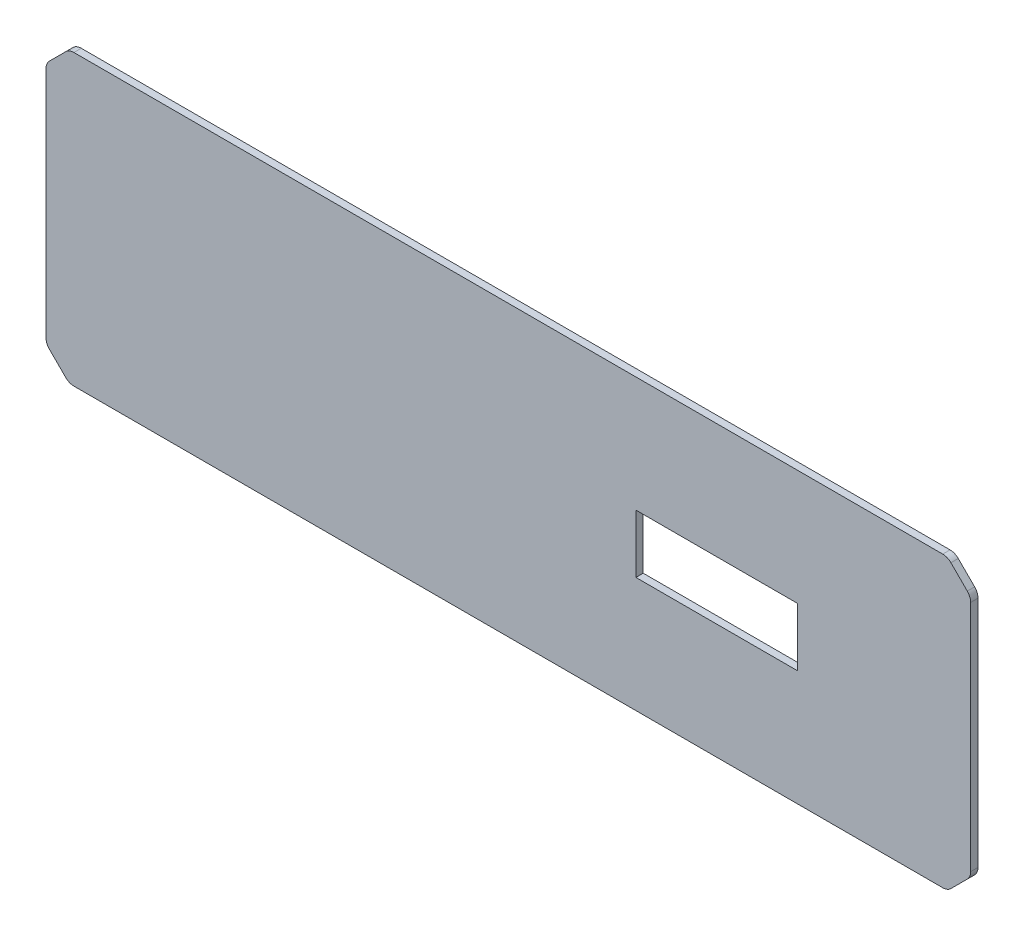
ISO-10303-21;
HEADER;
FILE_DESCRIPTION(('STEP AP214'),'2;1');
FILE_NAME('part.step','',(''),(''),'','','');
FILE_SCHEMA(('AUTOMOTIVE_DESIGN { 1 0 10303 214 1 1 1 1 }'));
ENDSEC;
DATA;
#1=APPLICATION_CONTEXT('core data for automotive mechanical design processes');
#2=APPLICATION_PROTOCOL_DEFINITION('international standard','automotive_design',2000,#1);
#3=PRODUCT_CONTEXT('',#1,'mechanical');
#4=PRODUCT('Part','Part','',(#3));
#5=PRODUCT_RELATED_PRODUCT_CATEGORY('part','',(#4));
#6=PRODUCT_DEFINITION_FORMATION('','',#4);
#7=PRODUCT_DEFINITION_CONTEXT('part definition',#1,'design');
#8=PRODUCT_DEFINITION('design','',#6,#7);
#9=PRODUCT_DEFINITION_SHAPE('','',#8);
#10=(LENGTH_UNIT() NAMED_UNIT(*) SI_UNIT(.MILLI.,.METRE.));
#11=(NAMED_UNIT(*) PLANE_ANGLE_UNIT() SI_UNIT($,.RADIAN.));
#12=(NAMED_UNIT(*) SI_UNIT($,.STERADIAN.) SOLID_ANGLE_UNIT());
#13=UNCERTAINTY_MEASURE_WITH_UNIT(LENGTH_MEASURE(1.E-05),#10,'distance_accuracy_value','');
#14=(GEOMETRIC_REPRESENTATION_CONTEXT(3) GLOBAL_UNCERTAINTY_ASSIGNED_CONTEXT((#13)) GLOBAL_UNIT_ASSIGNED_CONTEXT((#10,
#11,#12)) REPRESENTATION_CONTEXT('',''));
#15=CARTESIAN_POINT('',(0.,0.,0.));
#16=DIRECTION('',(0.,0.,1.));
#17=DIRECTION('',(1.,0.,0.));
#18=AXIS2_PLACEMENT_3D('',#15,#16,#17);
#19=CARTESIAN_POINT('',(200.,62.5,3.175));
#20=DIRECTION('',(-1.,0.,0.));
#21=DIRECTION('',(0.,0.,1.));
#22=AXIS2_PLACEMENT_3D('',#19,#20,#21);
#23=PLANE('',#22);
#24=DIRECTION('',(0.,1.,0.));
#25=VECTOR('',#24,1.);
#26=CARTESIAN_POINT('',(200.,62.5,3.175));
#27=LINE('',#26,#25);
#28=CARTESIAN_POINT('',(200.,-50.4289321881345,3.175));
#29=VERTEX_POINT('',#28);
#30=CARTESIAN_POINT('',(200.,50.4289321881345,3.175));
#31=VERTEX_POINT('',#30);
#32=EDGE_CURVE('E232',#29,#31,#27,.T.);
#33=ORIENTED_EDGE('',*,*,#32,.F.);
#34=DIRECTION('',(0.,0.,1.));
#35=VECTOR('',#34,1.);
#36=CARTESIAN_POINT('',(200.,-50.4289321881345,0.));
#37=LINE('',#36,#35);
#38=CARTESIAN_POINT('',(200.,-50.4289321881345,0.));
#39=VERTEX_POINT('',#38);
#40=EDGE_CURVE('E387',#29,#39,#37,.F.);
#41=ORIENTED_EDGE('',*,*,#40,.T.);
#42=DIRECTION('',(0.,1.,0.));
#43=VECTOR('',#42,1.);
#44=CARTESIAN_POINT('',(200.,62.5,0.));
#45=LINE('',#44,#43);
#46=CARTESIAN_POINT('',(200.,50.4289321881345,0.));
#47=VERTEX_POINT('',#46);
#48=EDGE_CURVE('E226',#39,#47,#45,.T.);
#49=ORIENTED_EDGE('',*,*,#48,.T.);
#50=DIRECTION('',(0.,0.,-1.));
#51=VECTOR('',#50,1.);
#52=CARTESIAN_POINT('',(200.,50.4289321881345,3.175));
#53=LINE('',#52,#51);
#54=EDGE_CURVE('E383',#47,#31,#53,.F.);
#55=ORIENTED_EDGE('',*,*,#54,.T.);
#56=EDGE_LOOP('',(#33,#41,#49,#55));
#57=FACE_BOUND('',#56,.T.);
#58=ADVANCED_FACE('F40',(#57),#23,.F.);
#59=CARTESIAN_POINT('',(-200.,62.5,3.175));
#60=DIRECTION('',(0.,-1.,0.));
#61=DIRECTION('',(0.,0.,-1.));
#62=AXIS2_PLACEMENT_3D('',#59,#60,#61);
#63=PLANE('',#62);
#64=DIRECTION('',(-1.,0.,0.));
#65=VECTOR('',#64,1.);
#66=CARTESIAN_POINT('',(-200.,62.5,0.));
#67=LINE('',#66,#65);
#68=CARTESIAN_POINT('',(187.928932188134,62.5,0.));
#69=VERTEX_POINT('',#68);
#70=CARTESIAN_POINT('',(-187.928932188135,62.5,0.));
#71=VERTEX_POINT('',#70);
#72=EDGE_CURVE('E253',#69,#71,#67,.T.);
#73=ORIENTED_EDGE('',*,*,#72,.T.);
#74=DIRECTION('',(0.,0.,-1.));
#75=VECTOR('',#74,1.);
#76=CARTESIAN_POINT('',(-187.928932188135,62.5,3.175));
#77=LINE('',#76,#75);
#78=CARTESIAN_POINT('',(-187.928932188135,62.5,3.175));
#79=VERTEX_POINT('',#78);
#80=EDGE_CURVE('E298',#71,#79,#77,.F.);
#81=ORIENTED_EDGE('',*,*,#80,.T.);
#82=DIRECTION('',(-1.,0.,0.));
#83=VECTOR('',#82,1.);
#84=CARTESIAN_POINT('',(-200.,62.5,3.175));
#85=LINE('',#84,#83);
#86=CARTESIAN_POINT('',(187.928932188134,62.5,3.175));
#87=VERTEX_POINT('',#86);
#88=EDGE_CURVE('E236',#87,#79,#85,.T.);
#89=ORIENTED_EDGE('',*,*,#88,.F.);
#90=DIRECTION('',(0.,0.,1.));
#91=VECTOR('',#90,1.);
#92=CARTESIAN_POINT('',(187.928932188134,62.5,0.));
#93=LINE('',#92,#91);
#94=EDGE_CURVE('E294',#87,#69,#93,.F.);
#95=ORIENTED_EDGE('',*,*,#94,.T.);
#96=EDGE_LOOP('',(#73,#81,#89,#95));
#97=FACE_BOUND('',#96,.T.);
#98=ADVANCED_FACE('F400',(#97),#63,.F.);
#99=CARTESIAN_POINT('',(-200.,62.5,3.175));
#100=DIRECTION('',(1.,0.,0.));
#101=DIRECTION('',(0.,1.,0.));
#102=AXIS2_PLACEMENT_3D('',#99,#100,#101);
#103=PLANE('',#102);
#104=DIRECTION('',(0.,-1.,0.));
#105=VECTOR('',#104,1.);
#106=CARTESIAN_POINT('',(-200.,62.5,3.175));
#107=LINE('',#106,#105);
#108=CARTESIAN_POINT('',(-200.,50.4289321881346,3.175));
#109=VERTEX_POINT('',#108);
#110=CARTESIAN_POINT('',(-200.,-50.4289321881345,3.175));
#111=VERTEX_POINT('',#110);
#112=EDGE_CURVE('E241',#109,#111,#107,.T.);
#113=ORIENTED_EDGE('',*,*,#112,.F.);
#114=DIRECTION('',(0.,0.,1.));
#115=VECTOR('',#114,1.);
#116=CARTESIAN_POINT('',(-200.,50.4289321881346,0.));
#117=LINE('',#116,#115);
#118=CARTESIAN_POINT('',(-200.,50.4289321881346,0.));
#119=VERTEX_POINT('',#118);
#120=EDGE_CURVE('E359',#109,#119,#117,.F.);
#121=ORIENTED_EDGE('',*,*,#120,.T.);
#122=DIRECTION('',(0.,-1.,0.));
#123=VECTOR('',#122,1.);
#124=CARTESIAN_POINT('',(-200.,62.5,0.));
#125=LINE('',#124,#123);
#126=CARTESIAN_POINT('',(-200.,-50.4289321881345,0.));
#127=VERTEX_POINT('',#126);
#128=EDGE_CURVE('E257',#119,#127,#125,.T.);
#129=ORIENTED_EDGE('',*,*,#128,.T.);
#130=DIRECTION('',(0.,0.,-1.));
#131=VECTOR('',#130,1.);
#132=CARTESIAN_POINT('',(-200.,-50.4289321881345,3.175));
#133=LINE('',#132,#131);
#134=EDGE_CURVE('E355',#127,#111,#133,.F.);
#135=ORIENTED_EDGE('',*,*,#134,.T.);
#136=EDGE_LOOP('',(#113,#121,#129,#135));
#137=FACE_BOUND('',#136,.T.);
#138=ADVANCED_FACE('F417',(#137),#103,.F.);
#139=CARTESIAN_POINT('',(-200.,-62.5,3.175));
#140=DIRECTION('',(0.,1.,0.));
#141=DIRECTION('',(0.,0.,1.));
#142=AXIS2_PLACEMENT_3D('',#139,#140,#141);
#143=PLANE('',#142);
#144=DIRECTION('',(1.,0.,0.));
#145=VECTOR('',#144,1.);
#146=CARTESIAN_POINT('',(-200.,-62.5,3.175));
#147=LINE('',#146,#145);
#148=CARTESIAN_POINT('',(-187.928932188134,-62.5,3.175));
#149=VERTEX_POINT('',#148);
#150=CARTESIAN_POINT('',(187.928932188134,-62.5,3.175));
#151=VERTEX_POINT('',#150);
#152=EDGE_CURVE('E245',#149,#151,#147,.T.);
#153=ORIENTED_EDGE('',*,*,#152,.F.);
#154=DIRECTION('',(0.,0.,1.));
#155=VECTOR('',#154,1.);
#156=CARTESIAN_POINT('',(-187.928932188134,-62.5,0.));
#157=LINE('',#156,#155);
#158=CARTESIAN_POINT('',(-187.928932188134,-62.5,0.));
#159=VERTEX_POINT('',#158);
#160=EDGE_CURVE('E373',#149,#159,#157,.F.);
#161=ORIENTED_EDGE('',*,*,#160,.T.);
#162=DIRECTION('',(1.,0.,0.));
#163=VECTOR('',#162,1.);
#164=CARTESIAN_POINT('',(-200.,-62.5,0.));
#165=LINE('',#164,#163);
#166=CARTESIAN_POINT('',(187.928932188134,-62.5,0.));
#167=VERTEX_POINT('',#166);
#168=EDGE_CURVE('E237',#159,#167,#165,.T.);
#169=ORIENTED_EDGE('',*,*,#168,.T.);
#170=DIRECTION('',(0.,0.,-1.));
#171=VECTOR('',#170,1.);
#172=CARTESIAN_POINT('',(187.928932188135,-62.5,3.175));
#173=LINE('',#172,#171);
#174=EDGE_CURVE('E369',#167,#151,#173,.F.);
#175=ORIENTED_EDGE('',*,*,#174,.T.);
#176=EDGE_LOOP('',(#153,#161,#169,#175));
#177=FACE_BOUND('',#176,.T.);
#178=ADVANCED_FACE('F435',(#177),#143,.F.);
#179=CARTESIAN_POINT('',(0.,0.,3.175));
#180=DIRECTION('',(0.,0.,1.));
#181=DIRECTION('',(1.,0.,0.));
#182=AXIS2_PLACEMENT_3D('',#179,#180,#181);
#183=PLANE('',#182);
#184=DIRECTION('',(0.,-1.,0.));
#185=VECTOR('',#184,1.);
#186=CARTESIAN_POINT('',(55.17,-12.615,3.175));
#187=LINE('',#186,#185);
#188=CARTESIAN_POINT('',(55.17,12.615,3.175));
#189=VERTEX_POINT('',#188);
#190=CARTESIAN_POINT('',(55.17,-12.615,3.175));
#191=VERTEX_POINT('',#190);
#192=EDGE_CURVE('E184',#189,#191,#187,.T.);
#193=ORIENTED_EDGE('',*,*,#192,.F.);
#194=DIRECTION('',(-1.,0.,0.));
#195=VECTOR('',#194,1.);
#196=CARTESIAN_POINT('',(125.,12.615,3.175));
#197=LINE('',#196,#195);
#198=CARTESIAN_POINT('',(125.,12.615,3.175));
#199=VERTEX_POINT('',#198);
#200=EDGE_CURVE('E204',#199,#189,#197,.T.);
#201=ORIENTED_EDGE('',*,*,#200,.F.);
#202=DIRECTION('',(0.,1.,0.));
#203=VECTOR('',#202,1.);
#204=CARTESIAN_POINT('',(125.,-12.615,3.175));
#205=LINE('',#204,#203);
#206=CARTESIAN_POINT('',(125.,-12.615,3.175));
#207=VERTEX_POINT('',#206);
#208=EDGE_CURVE('E208',#207,#199,#205,.T.);
#209=ORIENTED_EDGE('',*,*,#208,.F.);
#210=DIRECTION('',(1.,0.,0.));
#211=VECTOR('',#210,1.);
#212=CARTESIAN_POINT('',(125.,-12.615,3.175));
#213=LINE('',#212,#211);
#214=EDGE_CURVE('E217',#191,#207,#213,.T.);
#215=ORIENTED_EDGE('',*,*,#214,.F.);
#216=EDGE_LOOP('',(#193,#201,#209,#215));
#217=FACE_BOUND('',#216,.T.);
#218=ORIENTED_EDGE('',*,*,#88,.T.);
#219=CARTESIAN_POINT('',(-187.928932188135,57.5,3.175));
#220=DIRECTION('',(0.,0.,1.));
#221=DIRECTION('',(1.,0.,0.));
#222=AXIS2_PLACEMENT_3D('',#219,#220,#221);
#223=CIRCLE('',#222,5.);
#224=CARTESIAN_POINT('',(-191.464466094067,61.0355339059328,3.175));
#225=VERTEX_POINT('',#224);
#226=EDGE_CURVE('E323',#79,#225,#223,.T.);
#227=ORIENTED_EDGE('',*,*,#226,.T.);
#228=DIRECTION('',(0.707106781186548,0.707106781186548,0.));
#229=VECTOR('',#228,1.);
#230=CARTESIAN_POINT('',(-126.25,126.25,3.175));
#231=LINE('',#230,#229);
#232=CARTESIAN_POINT('',(-198.535533905933,53.9644660940673,3.175));
#233=VERTEX_POINT('',#232);
#234=EDGE_CURVE('E282',#225,#233,#231,.F.);
#235=ORIENTED_EDGE('',*,*,#234,.T.);
#236=CARTESIAN_POINT('',(-195.,50.4289321881346,3.175));
#237=DIRECTION('',(0.,0.,1.));
#238=DIRECTION('',(1.,0.,0.));
#239=AXIS2_PLACEMENT_3D('',#236,#237,#238);
#240=CIRCLE('',#239,5.);
#241=EDGE_CURVE('E320',#233,#109,#240,.T.);
#242=ORIENTED_EDGE('',*,*,#241,.T.);
#243=ORIENTED_EDGE('',*,*,#112,.T.);
#244=CARTESIAN_POINT('',(-195.,-50.4289321881345,3.175));
#245=DIRECTION('',(0.,0.,1.));
#246=DIRECTION('',(1.,0.,0.));
#247=AXIS2_PLACEMENT_3D('',#244,#245,#246);
#248=CIRCLE('',#247,5.);
#249=CARTESIAN_POINT('',(-198.535533905933,-53.9644660940672,3.175));
#250=VERTEX_POINT('',#249);
#251=EDGE_CURVE('E317',#111,#250,#248,.T.);
#252=ORIENTED_EDGE('',*,*,#251,.T.);
#253=DIRECTION('',(-0.707106781186546,0.707106781186549,0.));
#254=VECTOR('',#253,1.);
#255=CARTESIAN_POINT('',(-126.25,-126.25,3.175));
#256=LINE('',#255,#254);
#257=CARTESIAN_POINT('',(-191.464466094067,-61.0355339059327,3.175));
#258=VERTEX_POINT('',#257);
#259=EDGE_CURVE('E278',#250,#258,#256,.F.);
#260=ORIENTED_EDGE('',*,*,#259,.T.);
#261=CARTESIAN_POINT('',(-187.928932188134,-57.5,3.175));
#262=DIRECTION('',(0.,0.,1.));
#263=DIRECTION('',(1.,0.,0.));
#264=AXIS2_PLACEMENT_3D('',#261,#262,#263);
#265=CIRCLE('',#264,5.);
#266=EDGE_CURVE('E314',#258,#149,#265,.T.);
#267=ORIENTED_EDGE('',*,*,#266,.T.);
#268=ORIENTED_EDGE('',*,*,#152,.T.);
#269=CARTESIAN_POINT('',(187.928932188135,-57.5,3.175));
#270=DIRECTION('',(0.,0.,1.));
#271=DIRECTION('',(1.,0.,0.));
#272=AXIS2_PLACEMENT_3D('',#269,#270,#271);
#273=CIRCLE('',#272,5.);
#274=CARTESIAN_POINT('',(191.464466094067,-61.0355339059327,3.175));
#275=VERTEX_POINT('',#274);
#276=EDGE_CURVE('E311',#151,#275,#273,.T.);
#277=ORIENTED_EDGE('',*,*,#276,.T.);
#278=DIRECTION('',(-0.707106781186548,-0.707106781186548,0.));
#279=VECTOR('',#278,1.);
#280=CARTESIAN_POINT('',(126.25,-126.25,3.175));
#281=LINE('',#280,#279);
#282=CARTESIAN_POINT('',(198.535533905933,-53.9644660940673,3.175));
#283=VERTEX_POINT('',#282);
#284=EDGE_CURVE('E290',#275,#283,#281,.F.);
#285=ORIENTED_EDGE('',*,*,#284,.T.);
#286=CARTESIAN_POINT('',(195.,-50.4289321881345,3.175));
#287=DIRECTION('',(0.,0.,1.));
#288=DIRECTION('',(1.,0.,0.));
#289=AXIS2_PLACEMENT_3D('',#286,#287,#288);
#290=CIRCLE('',#289,5.);
#291=EDGE_CURVE('E308',#283,#29,#290,.T.);
#292=ORIENTED_EDGE('',*,*,#291,.T.);
#293=ORIENTED_EDGE('',*,*,#32,.T.);
#294=CARTESIAN_POINT('',(195.,50.4289321881345,3.175));
#295=DIRECTION('',(0.,0.,1.));
#296=DIRECTION('',(1.,0.,0.));
#297=AXIS2_PLACEMENT_3D('',#294,#295,#296);
#298=CIRCLE('',#297,5.);
#299=CARTESIAN_POINT('',(198.535533905933,53.9644660940672,3.175));
#300=VERTEX_POINT('',#299);
#301=EDGE_CURVE('E305',#31,#300,#298,.T.);
#302=ORIENTED_EDGE('',*,*,#301,.T.);
#303=DIRECTION('',(0.707106781186546,-0.707106781186549,0.));
#304=VECTOR('',#303,1.);
#305=CARTESIAN_POINT('',(126.250000000001,126.25,3.175));
#306=LINE('',#305,#304);
#307=CARTESIAN_POINT('',(191.464466094067,61.0355339059328,3.175));
#308=VERTEX_POINT('',#307);
#309=EDGE_CURVE('E286',#300,#308,#306,.F.);
#310=ORIENTED_EDGE('',*,*,#309,.T.);
#311=CARTESIAN_POINT('',(187.928932188134,57.5,3.175));
#312=DIRECTION('',(0.,0.,1.));
#313=DIRECTION('',(1.,0.,0.));
#314=AXIS2_PLACEMENT_3D('',#311,#312,#313);
#315=CIRCLE('',#314,5.);
#316=EDGE_CURVE('E302',#308,#87,#315,.T.);
#317=ORIENTED_EDGE('',*,*,#316,.T.);
#318=EDGE_LOOP('',(#218,#227,#235,#242,#243,#252,#260,#267,#268,#277,#285,#292,#293,#302,#310,#317));
#319=FACE_BOUND('',#318,.T.);
#320=ADVANCED_FACE('F396',(#217,#319),#183,.T.);
#321=CARTESIAN_POINT('',(0.,0.,0.));
#322=DIRECTION('',(0.,0.,1.));
#323=DIRECTION('',(1.,0.,0.));
#324=AXIS2_PLACEMENT_3D('',#321,#322,#323);
#325=PLANE('',#324);
#326=DIRECTION('',(-1.,0.,0.));
#327=VECTOR('',#326,1.);
#328=CARTESIAN_POINT('',(125.,12.615,0.));
#329=LINE('',#328,#327);
#330=CARTESIAN_POINT('',(125.,12.615,0.));
#331=VERTEX_POINT('',#330);
#332=CARTESIAN_POINT('',(55.17,12.615,0.));
#333=VERTEX_POINT('',#332);
#334=EDGE_CURVE('E190',#331,#333,#329,.T.);
#335=ORIENTED_EDGE('',*,*,#334,.T.);
#336=DIRECTION('',(0.,-1.,0.));
#337=VECTOR('',#336,1.);
#338=CARTESIAN_POINT('',(55.17,-12.615,0.));
#339=LINE('',#338,#337);
#340=CARTESIAN_POINT('',(55.17,-12.615,0.));
#341=VERTEX_POINT('',#340);
#342=EDGE_CURVE('E181',#333,#341,#339,.T.);
#343=ORIENTED_EDGE('',*,*,#342,.T.);
#344=DIRECTION('',(1.,0.,0.));
#345=VECTOR('',#344,1.);
#346=CARTESIAN_POINT('',(125.,-12.615,0.));
#347=LINE('',#346,#345);
#348=CARTESIAN_POINT('',(125.,-12.615,0.));
#349=VERTEX_POINT('',#348);
#350=EDGE_CURVE('E194',#341,#349,#347,.T.);
#351=ORIENTED_EDGE('',*,*,#350,.T.);
#352=DIRECTION('',(0.,1.,0.));
#353=VECTOR('',#352,1.);
#354=CARTESIAN_POINT('',(125.,-12.615,0.));
#355=LINE('',#354,#353);
#356=EDGE_CURVE('E199',#349,#331,#355,.T.);
#357=ORIENTED_EDGE('',*,*,#356,.T.);
#358=EDGE_LOOP('',(#335,#343,#351,#357));
#359=FACE_BOUND('',#358,.T.);
#360=DIRECTION('',(-0.707106781186548,-0.707106781186548,0.));
#361=VECTOR('',#360,1.);
#362=CARTESIAN_POINT('',(-200.,52.5,0.));
#363=LINE('',#362,#361);
#364=CARTESIAN_POINT('',(-198.535533905933,53.9644660940673,0.));
#365=VERTEX_POINT('',#364);
#366=CARTESIAN_POINT('',(-191.464466094067,61.0355339059328,0.));
#367=VERTEX_POINT('',#366);
#368=EDGE_CURVE('E267',#365,#367,#363,.F.);
#369=ORIENTED_EDGE('',*,*,#368,.T.);
#370=CARTESIAN_POINT('',(-187.928932188135,57.5,0.));
#371=DIRECTION('',(0.,0.,1.));
#372=DIRECTION('',(1.,0.,0.));
#373=AXIS2_PLACEMENT_3D('',#370,#371,#372);
#374=CIRCLE('',#373,5.);
#375=EDGE_CURVE('E352',#367,#71,#374,.F.);
#376=ORIENTED_EDGE('',*,*,#375,.T.);
#377=ORIENTED_EDGE('',*,*,#72,.F.);
#378=CARTESIAN_POINT('',(187.928932188134,57.5,0.));
#379=DIRECTION('',(0.,0.,1.));
#380=DIRECTION('',(1.,0.,0.));
#381=AXIS2_PLACEMENT_3D('',#378,#379,#380);
#382=CIRCLE('',#381,5.);
#383=CARTESIAN_POINT('',(191.464466094067,61.0355339059327,0.));
#384=VERTEX_POINT('',#383);
#385=EDGE_CURVE('E61',#69,#384,#382,.F.);
#386=ORIENTED_EDGE('',*,*,#385,.T.);
#387=DIRECTION('',(-0.707106781186546,0.707106781186549,0.));
#388=VECTOR('',#387,1.);
#389=CARTESIAN_POINT('',(190.,62.5,0.));
#390=LINE('',#389,#388);
#391=CARTESIAN_POINT('',(198.535533905933,53.9644660940672,0.));
#392=VERTEX_POINT('',#391);
#393=EDGE_CURVE('E271',#384,#392,#390,.F.);
#394=ORIENTED_EDGE('',*,*,#393,.T.);
#395=CARTESIAN_POINT('',(195.,50.4289321881345,0.));
#396=DIRECTION('',(0.,0.,1.));
#397=DIRECTION('',(1.,0.,0.));
#398=AXIS2_PLACEMENT_3D('',#395,#396,#397);
#399=CIRCLE('',#398,5.);
#400=EDGE_CURVE('E334',#392,#47,#399,.F.);
#401=ORIENTED_EDGE('',*,*,#400,.T.);
#402=ORIENTED_EDGE('',*,*,#48,.F.);
#403=CARTESIAN_POINT('',(195.,-50.4289321881345,0.));
#404=DIRECTION('',(0.,0.,1.));
#405=DIRECTION('',(1.,0.,0.));
#406=AXIS2_PLACEMENT_3D('',#403,#404,#405);
#407=CIRCLE('',#406,5.);
#408=CARTESIAN_POINT('',(198.535533905933,-53.9644660940673,0.));
#409=VERTEX_POINT('',#408);
#410=EDGE_CURVE('E337',#39,#409,#407,.F.);
#411=ORIENTED_EDGE('',*,*,#410,.T.);
#412=DIRECTION('',(0.707106781186548,0.707106781186548,0.));
#413=VECTOR('',#412,1.);
#414=CARTESIAN_POINT('',(200.,-52.5,0.));
#415=LINE('',#414,#413);
#416=CARTESIAN_POINT('',(191.464466094067,-61.0355339059327,0.));
#417=VERTEX_POINT('',#416);
#418=EDGE_CURVE('E274',#409,#417,#415,.F.);
#419=ORIENTED_EDGE('',*,*,#418,.T.);
#420=CARTESIAN_POINT('',(187.928932188135,-57.5,0.));
#421=DIRECTION('',(0.,0.,1.));
#422=DIRECTION('',(1.,0.,0.));
#423=AXIS2_PLACEMENT_3D('',#420,#421,#422);
#424=CIRCLE('',#423,5.);
#425=EDGE_CURVE('E340',#417,#167,#424,.F.);
#426=ORIENTED_EDGE('',*,*,#425,.T.);
#427=ORIENTED_EDGE('',*,*,#168,.F.);
#428=CARTESIAN_POINT('',(-187.928932188134,-57.5,0.));
#429=DIRECTION('',(0.,0.,1.));
#430=DIRECTION('',(1.,0.,0.));
#431=AXIS2_PLACEMENT_3D('',#428,#429,#430);
#432=CIRCLE('',#431,5.);
#433=CARTESIAN_POINT('',(-191.464466094067,-61.0355339059327,0.));
#434=VERTEX_POINT('',#433);
#435=EDGE_CURVE('E343',#159,#434,#432,.F.);
#436=ORIENTED_EDGE('',*,*,#435,.T.);
#437=DIRECTION('',(0.707106781186546,-0.707106781186549,0.));
#438=VECTOR('',#437,1.);
#439=CARTESIAN_POINT('',(-190.,-62.5,0.));
#440=LINE('',#439,#438);
#441=CARTESIAN_POINT('',(-198.535533905933,-53.9644660940672,0.));
#442=VERTEX_POINT('',#441);
#443=EDGE_CURVE('E249',#434,#442,#440,.F.);
#444=ORIENTED_EDGE('',*,*,#443,.T.);
#445=CARTESIAN_POINT('',(-195.,-50.4289321881345,0.));
#446=DIRECTION('',(0.,0.,1.));
#447=DIRECTION('',(1.,0.,0.));
#448=AXIS2_PLACEMENT_3D('',#445,#446,#447);
#449=CIRCLE('',#448,5.);
#450=EDGE_CURVE('E346',#442,#127,#449,.F.);
#451=ORIENTED_EDGE('',*,*,#450,.T.);
#452=ORIENTED_EDGE('',*,*,#128,.F.);
#453=CARTESIAN_POINT('',(-195.,50.4289321881346,0.));
#454=DIRECTION('',(0.,0.,1.));
#455=DIRECTION('',(1.,0.,0.));
#456=AXIS2_PLACEMENT_3D('',#453,#454,#455);
#457=CIRCLE('',#456,5.);
#458=EDGE_CURVE('E349',#119,#365,#457,.F.);
#459=ORIENTED_EDGE('',*,*,#458,.T.);
#460=EDGE_LOOP('',(#369,#376,#377,#386,#394,#401,#402,#411,#419,#426,#427,#436,#444,#451,#452,#459));
#461=FACE_BOUND('',#460,.T.);
#462=ADVANCED_FACE('F201',(#359,#461),#325,.F.);
#463=CARTESIAN_POINT('',(55.17,-12.615,0.));
#464=DIRECTION('',(-1.,0.,0.));
#465=DIRECTION('',(0.,0.,1.));
#466=AXIS2_PLACEMENT_3D('',#463,#464,#465);
#467=PLANE('',#466);
#468=ORIENTED_EDGE('',*,*,#192,.T.);
#469=DIRECTION('',(0.,0.,1.));
#470=VECTOR('',#469,1.);
#471=CARTESIAN_POINT('',(55.17,-12.615,0.));
#472=LINE('',#471,#470);
#473=EDGE_CURVE('E177',#341,#191,#472,.T.);
#474=ORIENTED_EDGE('',*,*,#473,.F.);
#475=ORIENTED_EDGE('',*,*,#342,.F.);
#476=DIRECTION('',(0.,0.,1.));
#477=VECTOR('',#476,1.);
#478=CARTESIAN_POINT('',(55.17,12.615,0.));
#479=LINE('',#478,#477);
#480=EDGE_CURVE('E223',#333,#189,#479,.T.);
#481=ORIENTED_EDGE('',*,*,#480,.T.);
#482=EDGE_LOOP('',(#468,#474,#475,#481));
#483=FACE_BOUND('',#482,.T.);
#484=ADVANCED_FACE('F179',(#483),#467,.F.);
#485=CARTESIAN_POINT('',(125.,12.615,0.));
#486=DIRECTION('',(0.,1.,0.));
#487=DIRECTION('',(-1.,0.,0.));
#488=AXIS2_PLACEMENT_3D('',#485,#486,#487);
#489=PLANE('',#488);
#490=ORIENTED_EDGE('',*,*,#200,.T.);
#491=ORIENTED_EDGE('',*,*,#480,.F.);
#492=ORIENTED_EDGE('',*,*,#334,.F.);
#493=DIRECTION('',(0.,0.,1.));
#494=VECTOR('',#493,1.);
#495=CARTESIAN_POINT('',(125.,12.615,0.));
#496=LINE('',#495,#494);
#497=EDGE_CURVE('E227',#331,#199,#496,.T.);
#498=ORIENTED_EDGE('',*,*,#497,.T.);
#499=EDGE_LOOP('',(#490,#491,#492,#498));
#500=FACE_BOUND('',#499,.T.);
#501=ADVANCED_FACE('F579',(#500),#489,.F.);
#502=CARTESIAN_POINT('',(125.,-12.615,0.));
#503=DIRECTION('',(1.,0.,0.));
#504=DIRECTION('',(0.,0.,-1.));
#505=AXIS2_PLACEMENT_3D('',#502,#503,#504);
#506=PLANE('',#505);
#507=ORIENTED_EDGE('',*,*,#208,.T.);
#508=ORIENTED_EDGE('',*,*,#497,.F.);
#509=ORIENTED_EDGE('',*,*,#356,.F.);
#510=DIRECTION('',(0.,0.,1.));
#511=VECTOR('',#510,1.);
#512=CARTESIAN_POINT('',(125.,-12.615,0.));
#513=LINE('',#512,#511);
#514=EDGE_CURVE('E189',#349,#207,#513,.T.);
#515=ORIENTED_EDGE('',*,*,#514,.T.);
#516=EDGE_LOOP('',(#507,#508,#509,#515));
#517=FACE_BOUND('',#516,.T.);
#518=ADVANCED_FACE('F571',(#517),#506,.F.);
#519=CARTESIAN_POINT('',(125.,-12.615,0.));
#520=DIRECTION('',(0.,-1.,0.));
#521=DIRECTION('',(1.,0.,0.));
#522=AXIS2_PLACEMENT_3D('',#519,#520,#521);
#523=PLANE('',#522);
#524=ORIENTED_EDGE('',*,*,#214,.T.);
#525=ORIENTED_EDGE('',*,*,#514,.F.);
#526=ORIENTED_EDGE('',*,*,#350,.F.);
#527=ORIENTED_EDGE('',*,*,#473,.T.);
#528=EDGE_LOOP('',(#524,#525,#526,#527));
#529=FACE_BOUND('',#528,.T.);
#530=ADVANCED_FACE('F195',(#529),#523,.F.);
#531=CARTESIAN_POINT('',(200.,-52.5,3.175));
#532=DIRECTION('',(-0.707106781186547,0.707106781186547,0.));
#533=DIRECTION('',(0.,0.,-1.));
#534=AXIS2_PLACEMENT_3D('',#531,#532,#533);
#535=PLANE('',#534);
#536=ORIENTED_EDGE('',*,*,#284,.F.);
#537=DIRECTION('',(0.,0.,1.));
#538=VECTOR('',#537,1.);
#539=CARTESIAN_POINT('',(191.464466094067,-61.0355339059327,0.));
#540=LINE('',#539,#538);
#541=EDGE_CURVE('E380',#275,#417,#540,.F.);
#542=ORIENTED_EDGE('',*,*,#541,.T.);
#543=ORIENTED_EDGE('',*,*,#418,.F.);
#544=DIRECTION('',(0.,0.,-1.));
#545=VECTOR('',#544,1.);
#546=CARTESIAN_POINT('',(198.535533905933,-53.9644660940673,3.175));
#547=LINE('',#546,#545);
#548=EDGE_CURVE('E377',#409,#283,#547,.F.);
#549=ORIENTED_EDGE('',*,*,#548,.T.);
#550=EDGE_LOOP('',(#536,#542,#543,#549));
#551=FACE_BOUND('',#550,.T.);
#552=ADVANCED_FACE('F445',(#551),#535,.F.);
#553=CARTESIAN_POINT('',(190.,62.5,3.175));
#554=DIRECTION('',(-0.707106781186549,-0.707106781186545,0.));
#555=DIRECTION('',(0.,0.,-1.));
#556=AXIS2_PLACEMENT_3D('',#553,#554,#555);
#557=PLANE('',#556);
#558=ORIENTED_EDGE('',*,*,#309,.F.);
#559=DIRECTION('',(0.,0.,1.));
#560=VECTOR('',#559,1.);
#561=CARTESIAN_POINT('',(198.535533905933,53.9644660940672,0.));
#562=LINE('',#561,#560);
#563=EDGE_CURVE('E11',#300,#392,#562,.F.);
#564=ORIENTED_EDGE('',*,*,#563,.T.);
#565=ORIENTED_EDGE('',*,*,#393,.F.);
#566=DIRECTION('',(0.,0.,-1.));
#567=VECTOR('',#566,1.);
#568=CARTESIAN_POINT('',(191.464466094067,61.0355339059327,3.175));
#569=LINE('',#568,#567);
#570=EDGE_CURVE('E49',#384,#308,#569,.F.);
#571=ORIENTED_EDGE('',*,*,#570,.T.);
#572=EDGE_LOOP('',(#558,#564,#565,#571));
#573=FACE_BOUND('',#572,.T.);
#574=ADVANCED_FACE('F392',(#573),#557,.F.);
#575=CARTESIAN_POINT('',(-200.,52.5,3.175));
#576=DIRECTION('',(0.707106781186548,-0.707106781186548,0.));
#577=DIRECTION('',(0.,0.,-1.));
#578=AXIS2_PLACEMENT_3D('',#575,#576,#577);
#579=PLANE('',#578);
#580=ORIENTED_EDGE('',*,*,#234,.F.);
#581=DIRECTION('',(0.,0.,1.));
#582=VECTOR('',#581,1.);
#583=CARTESIAN_POINT('',(-191.464466094067,61.0355339059327,0.));
#584=LINE('',#583,#582);
#585=EDGE_CURVE('E329',#225,#367,#584,.F.);
#586=ORIENTED_EDGE('',*,*,#585,.T.);
#587=ORIENTED_EDGE('',*,*,#368,.F.);
#588=DIRECTION('',(0.,0.,-1.));
#589=VECTOR('',#588,1.);
#590=CARTESIAN_POINT('',(-198.535533905933,53.9644660940673,3.175));
#591=LINE('',#590,#589);
#592=EDGE_CURVE('E326',#365,#233,#591,.F.);
#593=ORIENTED_EDGE('',*,*,#592,.T.);
#594=EDGE_LOOP('',(#580,#586,#587,#593));
#595=FACE_BOUND('',#594,.T.);
#596=ADVANCED_FACE('F410',(#595),#579,.F.);
#597=CARTESIAN_POINT('',(-190.,-62.5,3.175));
#598=DIRECTION('',(0.707106781186549,0.707106781186545,0.));
#599=DIRECTION('',(0.,0.,-1.));
#600=AXIS2_PLACEMENT_3D('',#597,#598,#599);
#601=PLANE('',#600);
#602=ORIENTED_EDGE('',*,*,#259,.F.);
#603=DIRECTION('',(0.,0.,1.));
#604=VECTOR('',#603,1.);
#605=CARTESIAN_POINT('',(-198.535533905933,-53.9644660940672,0.));
#606=LINE('',#605,#604);
#607=EDGE_CURVE('E366',#250,#442,#606,.F.);
#608=ORIENTED_EDGE('',*,*,#607,.T.);
#609=ORIENTED_EDGE('',*,*,#443,.F.);
#610=DIRECTION('',(0.,0.,-1.));
#611=VECTOR('',#610,1.);
#612=CARTESIAN_POINT('',(-191.464466094067,-61.0355339059327,3.175));
#613=LINE('',#612,#611);
#614=EDGE_CURVE('E363',#434,#258,#613,.F.);
#615=ORIENTED_EDGE('',*,*,#614,.T.);
#616=EDGE_LOOP('',(#602,#608,#609,#615));
#617=FACE_BOUND('',#616,.T.);
#618=ADVANCED_FACE('F427',(#617),#601,.F.);
#619=CARTESIAN_POINT('',(-187.928932188135,57.5,3.175));
#620=DIRECTION('',(0.,0.,1.));
#621=DIRECTION('',(1.,0.,0.));
#622=AXIS2_PLACEMENT_3D('',#619,#620,#621);
#623=CYLINDRICAL_SURFACE('',#622,5.);
#624=ORIENTED_EDGE('',*,*,#375,.F.);
#625=ORIENTED_EDGE('',*,*,#585,.F.);
#626=ORIENTED_EDGE('',*,*,#226,.F.);
#627=ORIENTED_EDGE('',*,*,#80,.F.);
#628=EDGE_LOOP('',(#624,#625,#626,#627));
#629=FACE_BOUND('',#628,.T.);
#630=ADVANCED_FACE('F406',(#629),#623,.T.);
#631=CARTESIAN_POINT('',(-195.,50.4289321881346,3.175));
#632=DIRECTION('',(0.,0.,-1.));
#633=DIRECTION('',(-1.,0.,0.));
#634=AXIS2_PLACEMENT_3D('',#631,#632,#633);
#635=CYLINDRICAL_SURFACE('',#634,5.);
#636=ORIENTED_EDGE('',*,*,#241,.F.);
#637=ORIENTED_EDGE('',*,*,#592,.F.);
#638=ORIENTED_EDGE('',*,*,#458,.F.);
#639=ORIENTED_EDGE('',*,*,#120,.F.);
#640=EDGE_LOOP('',(#636,#637,#638,#639));
#641=FACE_BOUND('',#640,.T.);
#642=ADVANCED_FACE('F413',(#641),#635,.T.);
#643=CARTESIAN_POINT('',(-195.,-50.4289321881345,3.175));
#644=DIRECTION('',(0.,0.,1.));
#645=DIRECTION('',(1.,0.,0.));
#646=AXIS2_PLACEMENT_3D('',#643,#644,#645);
#647=CYLINDRICAL_SURFACE('',#646,5.);
#648=ORIENTED_EDGE('',*,*,#450,.F.);
#649=ORIENTED_EDGE('',*,*,#607,.F.);
#650=ORIENTED_EDGE('',*,*,#251,.F.);
#651=ORIENTED_EDGE('',*,*,#134,.F.);
#652=EDGE_LOOP('',(#648,#649,#650,#651));
#653=FACE_BOUND('',#652,.T.);
#654=ADVANCED_FACE('F422',(#653),#647,.T.);
#655=CARTESIAN_POINT('',(-187.928932188134,-57.5,3.175));
#656=DIRECTION('',(0.,0.,-1.));
#657=DIRECTION('',(-1.,0.,0.));
#658=AXIS2_PLACEMENT_3D('',#655,#656,#657);
#659=CYLINDRICAL_SURFACE('',#658,5.);
#660=ORIENTED_EDGE('',*,*,#266,.F.);
#661=ORIENTED_EDGE('',*,*,#614,.F.);
#662=ORIENTED_EDGE('',*,*,#435,.F.);
#663=ORIENTED_EDGE('',*,*,#160,.F.);
#664=EDGE_LOOP('',(#660,#661,#662,#663));
#665=FACE_BOUND('',#664,.T.);
#666=ADVANCED_FACE('F431',(#665),#659,.T.);
#667=CARTESIAN_POINT('',(187.928932188135,-57.5,3.175));
#668=DIRECTION('',(0.,0.,1.));
#669=DIRECTION('',(1.,0.,0.));
#670=AXIS2_PLACEMENT_3D('',#667,#668,#669);
#671=CYLINDRICAL_SURFACE('',#670,5.);
#672=ORIENTED_EDGE('',*,*,#425,.F.);
#673=ORIENTED_EDGE('',*,*,#541,.F.);
#674=ORIENTED_EDGE('',*,*,#276,.F.);
#675=ORIENTED_EDGE('',*,*,#174,.F.);
#676=EDGE_LOOP('',(#672,#673,#674,#675));
#677=FACE_BOUND('',#676,.T.);
#678=ADVANCED_FACE('F440',(#677),#671,.T.);
#679=CARTESIAN_POINT('',(195.,-50.4289321881345,3.175));
#680=DIRECTION('',(0.,0.,-1.));
#681=DIRECTION('',(-1.,0.,0.));
#682=AXIS2_PLACEMENT_3D('',#679,#680,#681);
#683=CYLINDRICAL_SURFACE('',#682,5.);
#684=ORIENTED_EDGE('',*,*,#291,.F.);
#685=ORIENTED_EDGE('',*,*,#548,.F.);
#686=ORIENTED_EDGE('',*,*,#410,.F.);
#687=ORIENTED_EDGE('',*,*,#40,.F.);
#688=EDGE_LOOP('',(#684,#685,#686,#687));
#689=FACE_BOUND('',#688,.T.);
#690=ADVANCED_FACE('F449',(#689),#683,.T.);
#691=CARTESIAN_POINT('',(195.,50.4289321881345,3.175));
#692=DIRECTION('',(0.,0.,1.));
#693=DIRECTION('',(1.,0.,0.));
#694=AXIS2_PLACEMENT_3D('',#691,#692,#693);
#695=CYLINDRICAL_SURFACE('',#694,5.);
#696=ORIENTED_EDGE('',*,*,#400,.F.);
#697=ORIENTED_EDGE('',*,*,#563,.F.);
#698=ORIENTED_EDGE('',*,*,#301,.F.);
#699=ORIENTED_EDGE('',*,*,#54,.F.);
#700=EDGE_LOOP('',(#696,#697,#698,#699));
#701=FACE_BOUND('',#700,.T.);
#702=ADVANCED_FACE('F457',(#701),#695,.T.);
#703=CARTESIAN_POINT('',(187.928932188134,57.5,3.175));
#704=DIRECTION('',(0.,0.,-1.));
#705=DIRECTION('',(-1.,0.,0.));
#706=AXIS2_PLACEMENT_3D('',#703,#704,#705);
#707=CYLINDRICAL_SURFACE('',#706,5.);
#708=ORIENTED_EDGE('',*,*,#316,.F.);
#709=ORIENTED_EDGE('',*,*,#570,.F.);
#710=ORIENTED_EDGE('',*,*,#385,.F.);
#711=ORIENTED_EDGE('',*,*,#94,.F.);
#712=EDGE_LOOP('',(#708,#709,#710,#711));
#713=FACE_BOUND('',#712,.T.);
#714=ADVANCED_FACE('F42',(#713),#707,.T.);
#715=CLOSED_SHELL('',(#58,#98,#138,#178,#320,#462,#484,#501,#518,#530,#552,#574,#596,#618,#630,
#642,#654,#666,#678,#690,#702,#714));
#716=MANIFOLD_SOLID_BREP('B2',#715);
#717=ADVANCED_BREP_SHAPE_REPRESENTATION('',(#18,#716),#14);
#718=SHAPE_DEFINITION_REPRESENTATION(#9,#717);
ENDSEC;
END-ISO-10303-21;
